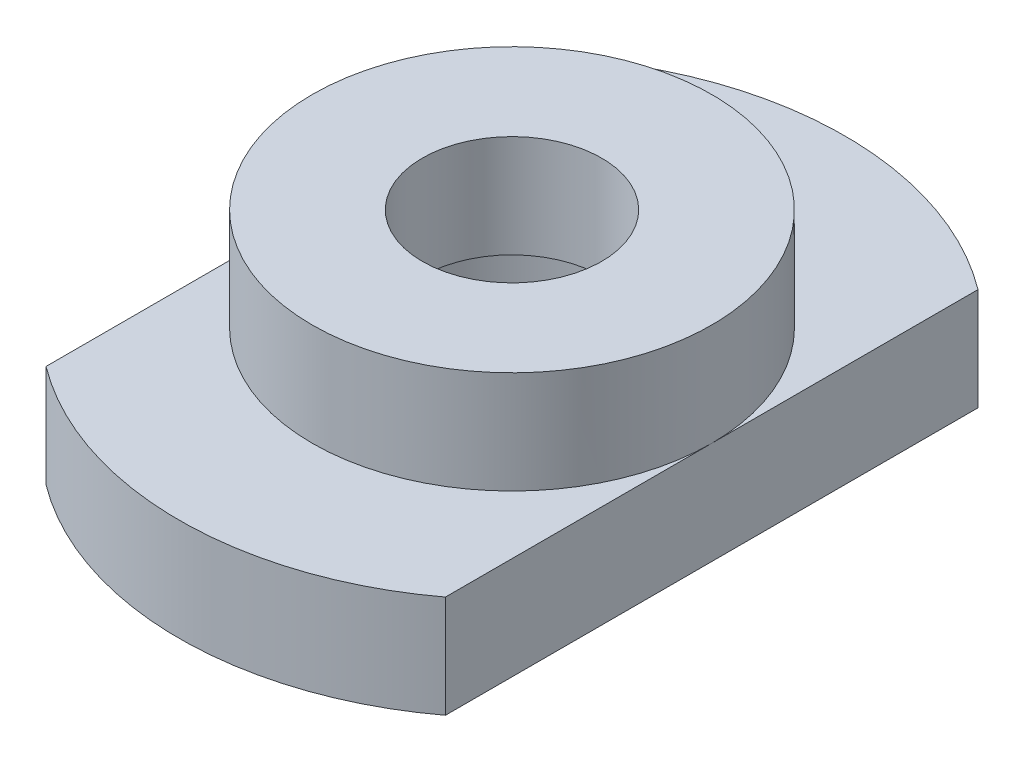
ISO-10303-21;
HEADER;
FILE_DESCRIPTION(('STEP AP214'),'2;1');
FILE_NAME('part.step','',(''),(''),'','','');
FILE_SCHEMA(('AUTOMOTIVE_DESIGN { 1 0 10303 214 1 1 1 1 }'));
ENDSEC;
DATA;
#1=APPLICATION_CONTEXT('core data for automotive mechanical design processes');
#2=APPLICATION_PROTOCOL_DEFINITION('international standard','automotive_design',2000,#1);
#3=PRODUCT_CONTEXT('',#1,'mechanical');
#4=PRODUCT('Part','Part','',(#3));
#5=PRODUCT_RELATED_PRODUCT_CATEGORY('part','',(#4));
#6=PRODUCT_DEFINITION_FORMATION('','',#4);
#7=PRODUCT_DEFINITION_CONTEXT('part definition',#1,'design');
#8=PRODUCT_DEFINITION('design','',#6,#7);
#9=PRODUCT_DEFINITION_SHAPE('','',#8);
#10=(LENGTH_UNIT() NAMED_UNIT(*) SI_UNIT(.MILLI.,.METRE.));
#11=(NAMED_UNIT(*) PLANE_ANGLE_UNIT() SI_UNIT($,.RADIAN.));
#12=(NAMED_UNIT(*) SI_UNIT($,.STERADIAN.) SOLID_ANGLE_UNIT());
#13=UNCERTAINTY_MEASURE_WITH_UNIT(LENGTH_MEASURE(1.E-05),#10,'distance_accuracy_value','');
#14=(GEOMETRIC_REPRESENTATION_CONTEXT(3) GLOBAL_UNCERTAINTY_ASSIGNED_CONTEXT((#13)) GLOBAL_UNIT_ASSIGNED_CONTEXT((#10,
#11,#12)) REPRESENTATION_CONTEXT('',''));
#15=CARTESIAN_POINT('',(0.,0.,0.));
#16=DIRECTION('',(0.,0.,1.));
#17=DIRECTION('',(1.,0.,0.));
#18=AXIS2_PLACEMENT_3D('',#15,#16,#17);
#19=CARTESIAN_POINT('',(0.,2.,0.));
#20=DIRECTION('',(0.,1.,0.));
#21=DIRECTION('',(0.,0.,1.));
#22=AXIS2_PLACEMENT_3D('',#19,#20,#21);
#23=PLANE('',#22);
#24=CARTESIAN_POINT('',(0.,2.,0.));
#25=DIRECTION('',(0.,1.,0.));
#26=DIRECTION('',(0.,0.,1.));
#27=AXIS2_PLACEMENT_3D('',#24,#25,#26);
#28=CIRCLE('',#27,3.9);
#29=CARTESIAN_POINT('',(3.9,2.,0.));
#30=VERTEX_POINT('',#29);
#31=CARTESIAN_POINT('',(-3.9,2.,0.));
#32=VERTEX_POINT('',#31);
#33=EDGE_CURVE('E58',#30,#32,#28,.T.);
#34=ORIENTED_EDGE('',*,*,#33,.F.);
#35=DIRECTION('',(0.,0.,1.));
#36=VECTOR('',#35,1.);
#37=CARTESIAN_POINT('',(3.9,2.,0.));
#38=LINE('',#37,#36);
#39=CARTESIAN_POINT('',(3.9,2.,-5.2));
#40=VERTEX_POINT('',#39);
#41=EDGE_CURVE('E103',#40,#30,#38,.T.);
#42=ORIENTED_EDGE('',*,*,#41,.F.);
#43=CARTESIAN_POINT('',(0.,2.,0.));
#44=DIRECTION('',(0.,1.,0.));
#45=DIRECTION('',(0.,0.,1.));
#46=AXIS2_PLACEMENT_3D('',#43,#44,#45);
#47=CIRCLE('',#46,6.5);
#48=CARTESIAN_POINT('',(-3.9,2.,-5.2));
#49=VERTEX_POINT('',#48);
#50=EDGE_CURVE('E72',#40,#49,#47,.T.);
#51=ORIENTED_EDGE('',*,*,#50,.T.);
#52=DIRECTION('',(0.,0.,1.));
#53=VECTOR('',#52,1.);
#54=CARTESIAN_POINT('',(-3.9,2.,0.));
#55=LINE('',#54,#53);
#56=EDGE_CURVE('E117',#49,#32,#55,.T.);
#57=ORIENTED_EDGE('',*,*,#56,.T.);
#58=EDGE_LOOP('',(#34,#42,#51,#57));
#59=FACE_BOUND('',#58,.T.);
#60=ADVANCED_FACE('F47',(#59),#23,.T.);
#61=CARTESIAN_POINT('',(-3.9,2.,0.));
#62=DIRECTION('',(1.,0.,0.));
#63=DIRECTION('',(0.,0.,-1.));
#64=AXIS2_PLACEMENT_3D('',#61,#62,#63);
#65=PLANE('',#64);
#66=DIRECTION('',(0.,0.,1.));
#67=VECTOR('',#66,1.);
#68=CARTESIAN_POINT('',(-3.9,0.,0.));
#69=LINE('',#68,#67);
#70=CARTESIAN_POINT('',(-3.9,0.,-5.2));
#71=VERTEX_POINT('',#70);
#72=CARTESIAN_POINT('',(-3.9,0.,5.2));
#73=VERTEX_POINT('',#72);
#74=EDGE_CURVE('E172',#71,#73,#69,.T.);
#75=ORIENTED_EDGE('',*,*,#74,.T.);
#76=DIRECTION('',(0.,-1.,0.));
#77=VECTOR('',#76,1.);
#78=CARTESIAN_POINT('',(-3.9,2.,5.2));
#79=LINE('',#78,#77);
#80=CARTESIAN_POINT('',(-3.9,2.,5.2));
#81=VERTEX_POINT('',#80);
#82=EDGE_CURVE('E51',#81,#73,#79,.T.);
#83=ORIENTED_EDGE('',*,*,#82,.F.);
#84=EDGE_CURVE('E97',#32,#81,#55,.T.);
#85=ORIENTED_EDGE('',*,*,#84,.F.);
#86=ORIENTED_EDGE('',*,*,#56,.F.);
#87=DIRECTION('',(0.,-1.,0.));
#88=VECTOR('',#87,1.);
#89=CARTESIAN_POINT('',(-3.9,2.,-5.2));
#90=LINE('',#89,#88);
#91=EDGE_CURVE('E179',#49,#71,#90,.T.);
#92=ORIENTED_EDGE('',*,*,#91,.T.);
#93=EDGE_LOOP('',(#75,#83,#85,#86,#92));
#94=FACE_BOUND('',#93,.T.);
#95=ADVANCED_FACE('F140',(#94),#65,.F.);
#96=CARTESIAN_POINT('',(0.,2.,0.));
#97=DIRECTION('',(0.,-1.,0.));
#98=DIRECTION('',(0.,0.,-1.));
#99=AXIS2_PLACEMENT_3D('',#96,#97,#98);
#100=CYLINDRICAL_SURFACE('',#99,6.5);
#101=CARTESIAN_POINT('',(0.,0.,0.));
#102=DIRECTION('',(0.,1.,0.));
#103=DIRECTION('',(0.,0.,1.));
#104=AXIS2_PLACEMENT_3D('',#101,#102,#103);
#105=CIRCLE('',#104,6.5);
#106=CARTESIAN_POINT('',(3.9,0.,5.2));
#107=VERTEX_POINT('',#106);
#108=EDGE_CURVE('E163',#73,#107,#105,.T.);
#109=ORIENTED_EDGE('',*,*,#108,.T.);
#110=DIRECTION('',(0.,-1.,0.));
#111=VECTOR('',#110,1.);
#112=CARTESIAN_POINT('',(3.9,2.,5.2));
#113=LINE('',#112,#111);
#114=CARTESIAN_POINT('',(3.9,2.,5.2));
#115=VERTEX_POINT('',#114);
#116=EDGE_CURVE('E165',#115,#107,#113,.T.);
#117=ORIENTED_EDGE('',*,*,#116,.F.);
#118=EDGE_CURVE('E112',#81,#115,#47,.T.);
#119=ORIENTED_EDGE('',*,*,#118,.F.);
#120=ORIENTED_EDGE('',*,*,#82,.T.);
#121=EDGE_LOOP('',(#109,#117,#119,#120));
#122=FACE_BOUND('',#121,.T.);
#123=ADVANCED_FACE('F144',(#122),#100,.T.);
#124=CARTESIAN_POINT('',(3.9,2.,0.));
#125=DIRECTION('',(1.,0.,0.));
#126=DIRECTION('',(0.,0.,-1.));
#127=AXIS2_PLACEMENT_3D('',#124,#125,#126);
#128=PLANE('',#127);
#129=DIRECTION('',(0.,0.,1.));
#130=VECTOR('',#129,1.);
#131=CARTESIAN_POINT('',(3.9,0.,0.));
#132=LINE('',#131,#130);
#133=CARTESIAN_POINT('',(3.9,0.,-5.2));
#134=VERTEX_POINT('',#133);
#135=EDGE_CURVE('E171',#134,#107,#132,.T.);
#136=ORIENTED_EDGE('',*,*,#135,.F.);
#137=DIRECTION('',(0.,-1.,0.));
#138=VECTOR('',#137,1.);
#139=CARTESIAN_POINT('',(3.9,2.,-5.2));
#140=LINE('',#139,#138);
#141=EDGE_CURVE('E107',#40,#134,#140,.T.);
#142=ORIENTED_EDGE('',*,*,#141,.F.);
#143=ORIENTED_EDGE('',*,*,#41,.T.);
#144=EDGE_CURVE('E106',#30,#115,#38,.T.);
#145=ORIENTED_EDGE('',*,*,#144,.T.);
#146=ORIENTED_EDGE('',*,*,#116,.T.);
#147=EDGE_LOOP('',(#136,#142,#143,#145,#146));
#148=FACE_BOUND('',#147,.T.);
#149=ADVANCED_FACE('F105',(#148),#128,.T.);
#150=CARTESIAN_POINT('',(0.,2.,0.));
#151=DIRECTION('',(0.,-1.,0.));
#152=DIRECTION('',(0.,0.,-1.));
#153=AXIS2_PLACEMENT_3D('',#150,#151,#152);
#154=CYLINDRICAL_SURFACE('',#153,2.9);
#155=CARTESIAN_POINT('',(0.,2.,0.));
#156=DIRECTION('',(0.,1.,0.));
#157=DIRECTION('',(0.,0.,1.));
#158=AXIS2_PLACEMENT_3D('',#155,#156,#157);
#159=CIRCLE('',#158,2.9);
#160=CARTESIAN_POINT('',(0.,2.,2.9));
#161=VERTEX_POINT('',#160);
#162=EDGE_CURVE('E192',#161,#161,#159,.T.);
#163=ORIENTED_EDGE('',*,*,#162,.T.);
#164=EDGE_LOOP('',(#163));
#165=FACE_BOUND('',#164,.T.);
#166=CARTESIAN_POINT('',(0.,0.,0.));
#167=DIRECTION('',(0.,1.,0.));
#168=DIRECTION('',(0.,0.,1.));
#169=AXIS2_PLACEMENT_3D('',#166,#167,#168);
#170=CIRCLE('',#169,2.9);
#171=CARTESIAN_POINT('',(0.,0.,2.9));
#172=VERTEX_POINT('',#171);
#173=EDGE_CURVE('E195',#172,#172,#170,.T.);
#174=ORIENTED_EDGE('',*,*,#173,.F.);
#175=EDGE_LOOP('',(#174));
#176=FACE_BOUND('',#175,.T.);
#177=ADVANCED_FACE('F49',(#165,#176),#154,.F.);
#178=EDGE_CURVE('E93',#134,#71,#105,.T.);
#179=ORIENTED_EDGE('',*,*,#178,.T.);
#180=ORIENTED_EDGE('',*,*,#91,.F.);
#181=ORIENTED_EDGE('',*,*,#50,.F.);
#182=ORIENTED_EDGE('',*,*,#141,.T.);
#183=EDGE_LOOP('',(#179,#180,#181,#182));
#184=FACE_BOUND('',#183,.T.);
#185=ADVANCED_FACE('F146',(#184),#100,.T.);
#186=EDGE_CURVE('E11',#32,#30,#28,.T.);
#187=ORIENTED_EDGE('',*,*,#186,.F.);
#188=ORIENTED_EDGE('',*,*,#84,.T.);
#189=ORIENTED_EDGE('',*,*,#118,.T.);
#190=ORIENTED_EDGE('',*,*,#144,.F.);
#191=EDGE_LOOP('',(#187,#188,#189,#190));
#192=FACE_BOUND('',#191,.T.);
#193=ADVANCED_FACE('F111',(#192),#23,.T.);
#194=CARTESIAN_POINT('',(0.,0.,0.));
#195=DIRECTION('',(0.,1.,0.));
#196=DIRECTION('',(0.,0.,1.));
#197=AXIS2_PLACEMENT_3D('',#194,#195,#196);
#198=PLANE('',#197);
#199=ORIENTED_EDGE('',*,*,#173,.T.);
#200=EDGE_LOOP('',(#199));
#201=FACE_BOUND('',#200,.T.);
#202=ORIENTED_EDGE('',*,*,#74,.F.);
#203=ORIENTED_EDGE('',*,*,#178,.F.);
#204=ORIENTED_EDGE('',*,*,#135,.T.);
#205=ORIENTED_EDGE('',*,*,#108,.F.);
#206=EDGE_LOOP('',(#202,#203,#204,#205));
#207=FACE_BOUND('',#206,.T.);
#208=ADVANCED_FACE('F124',(#201,#207),#198,.F.);
#209=CARTESIAN_POINT('',(0.,4.,0.));
#210=DIRECTION('',(0.,-1.,0.));
#211=DIRECTION('',(0.,0.,-1.));
#212=AXIS2_PLACEMENT_3D('',#209,#210,#211);
#213=CYLINDRICAL_SURFACE('',#212,3.9);
#214=CARTESIAN_POINT('',(0.,4.,0.));
#215=DIRECTION('',(0.,1.,0.));
#216=DIRECTION('',(0.,0.,1.));
#217=AXIS2_PLACEMENT_3D('',#214,#215,#216);
#218=CIRCLE('',#217,3.9);
#219=CARTESIAN_POINT('',(0.,4.,3.9));
#220=VERTEX_POINT('',#219);
#221=EDGE_CURVE('E205',#220,#220,#218,.T.);
#222=ORIENTED_EDGE('',*,*,#221,.F.);
#223=EDGE_LOOP('',(#222));
#224=FACE_BOUND('',#223,.T.);
#225=ORIENTED_EDGE('',*,*,#33,.T.);
#226=ORIENTED_EDGE('',*,*,#186,.T.);
#227=EDGE_LOOP('',(#225,#226));
#228=FACE_BOUND('',#227,.T.);
#229=ADVANCED_FACE('F121',(#224,#228),#213,.T.);
#230=CARTESIAN_POINT('',(0.,4.,0.));
#231=DIRECTION('',(0.,-1.,0.));
#232=DIRECTION('',(0.,0.,-1.));
#233=AXIS2_PLACEMENT_3D('',#230,#231,#232);
#234=CYLINDRICAL_SURFACE('',#233,1.75);
#235=CARTESIAN_POINT('',(0.,4.,0.));
#236=DIRECTION('',(0.,1.,0.));
#237=DIRECTION('',(0.,0.,1.));
#238=AXIS2_PLACEMENT_3D('',#235,#236,#237);
#239=CIRCLE('',#238,1.75);
#240=CARTESIAN_POINT('',(0.,4.,1.75));
#241=VERTEX_POINT('',#240);
#242=EDGE_CURVE('E202',#241,#241,#239,.T.);
#243=ORIENTED_EDGE('',*,*,#242,.T.);
#244=EDGE_LOOP('',(#243));
#245=FACE_BOUND('',#244,.T.);
#246=CARTESIAN_POINT('',(0.,2.,0.));
#247=DIRECTION('',(0.,1.,0.));
#248=DIRECTION('',(0.,0.,1.));
#249=AXIS2_PLACEMENT_3D('',#246,#247,#248);
#250=CIRCLE('',#249,1.75);
#251=CARTESIAN_POINT('',(0.,2.,1.75));
#252=VERTEX_POINT('',#251);
#253=EDGE_CURVE('E120',#252,#252,#250,.T.);
#254=ORIENTED_EDGE('',*,*,#253,.F.);
#255=EDGE_LOOP('',(#254));
#256=FACE_BOUND('',#255,.T.);
#257=ADVANCED_FACE('F123',(#245,#256),#234,.F.);
#258=CARTESIAN_POINT('',(0.,4.,0.));
#259=DIRECTION('',(0.,1.,0.));
#260=DIRECTION('',(0.,0.,1.));
#261=AXIS2_PLACEMENT_3D('',#258,#259,#260);
#262=PLANE('',#261);
#263=ORIENTED_EDGE('',*,*,#221,.T.);
#264=EDGE_LOOP('',(#263));
#265=FACE_BOUND('',#264,.T.);
#266=ORIENTED_EDGE('',*,*,#242,.F.);
#267=EDGE_LOOP('',(#266));
#268=FACE_BOUND('',#267,.T.);
#269=ADVANCED_FACE('F131',(#265,#268),#262,.T.);
#270=CARTESIAN_POINT('',(0.,2.,0.));
#271=DIRECTION('',(0.,1.,0.));
#272=DIRECTION('',(0.,0.,1.));
#273=AXIS2_PLACEMENT_3D('',#270,#271,#272);
#274=PLANE('',#273);
#275=ORIENTED_EDGE('',*,*,#162,.F.);
#276=EDGE_LOOP('',(#275));
#277=FACE_BOUND('',#276,.T.);
#278=ORIENTED_EDGE('',*,*,#253,.T.);
#279=EDGE_LOOP('',(#278));
#280=FACE_BOUND('',#279,.T.);
#281=ADVANCED_FACE('F213',(#277,#280),#274,.F.);
#282=CLOSED_SHELL('',(#60,#95,#123,#149,#177,#185,#193,#208,#229,#257,#269,#281));
#283=MANIFOLD_SOLID_BREP('B2',#282);
#284=ADVANCED_BREP_SHAPE_REPRESENTATION('',(#18,#283),#14);
#285=SHAPE_DEFINITION_REPRESENTATION(#9,#284);
ENDSEC;
END-ISO-10303-21;
